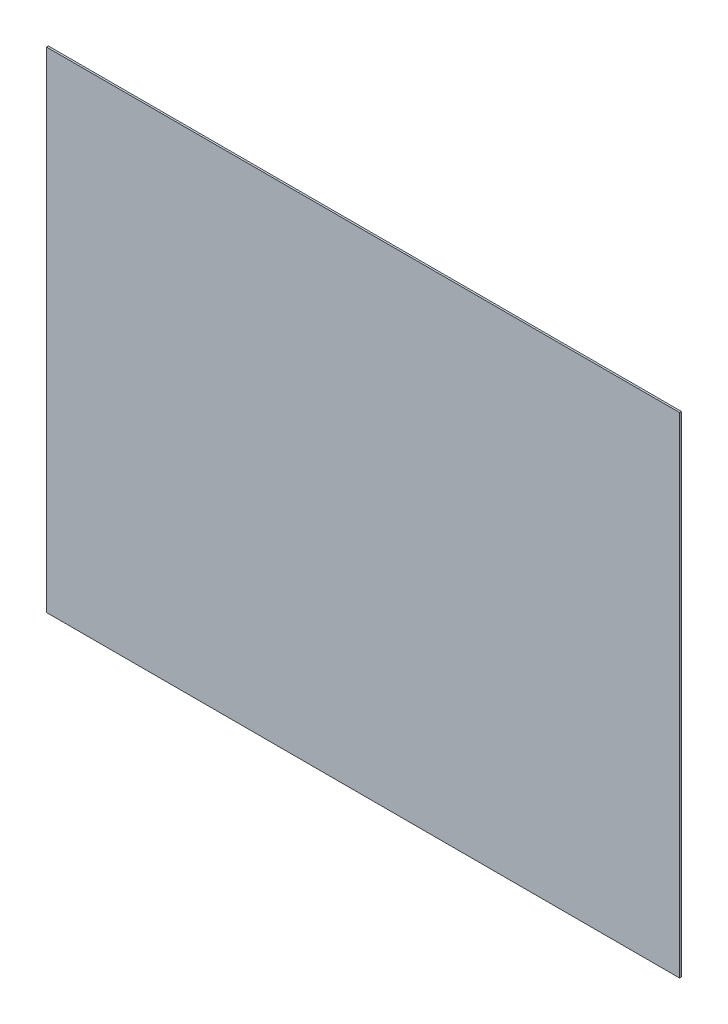
ISO-10303-21;
HEADER;
FILE_DESCRIPTION(('STEP AP214'),'2;1');
FILE_NAME('part.step','',(''),(''),'','','');
FILE_SCHEMA(('AUTOMOTIVE_DESIGN { 1 0 10303 214 1 1 1 1 }'));
ENDSEC;
DATA;
#1=APPLICATION_CONTEXT('core data for automotive mechanical design processes');
#2=APPLICATION_PROTOCOL_DEFINITION('international standard','automotive_design',2000,#1);
#3=PRODUCT_CONTEXT('',#1,'mechanical');
#4=PRODUCT('Part','Part','',(#3));
#5=PRODUCT_RELATED_PRODUCT_CATEGORY('part','',(#4));
#6=PRODUCT_DEFINITION_FORMATION('','',#4);
#7=PRODUCT_DEFINITION_CONTEXT('part definition',#1,'design');
#8=PRODUCT_DEFINITION('design','',#6,#7);
#9=PRODUCT_DEFINITION_SHAPE('','',#8);
#10=(LENGTH_UNIT() NAMED_UNIT(*) SI_UNIT(.MILLI.,.METRE.));
#11=(NAMED_UNIT(*) PLANE_ANGLE_UNIT() SI_UNIT($,.RADIAN.));
#12=(NAMED_UNIT(*) SI_UNIT($,.STERADIAN.) SOLID_ANGLE_UNIT());
#13=UNCERTAINTY_MEASURE_WITH_UNIT(LENGTH_MEASURE(1.E-05),#10,'distance_accuracy_value','');
#14=(GEOMETRIC_REPRESENTATION_CONTEXT(3) GLOBAL_UNCERTAINTY_ASSIGNED_CONTEXT((#13)) GLOBAL_UNIT_ASSIGNED_CONTEXT((#10,
#11,#12)) REPRESENTATION_CONTEXT('',''));
#15=CARTESIAN_POINT('',(0.,0.,0.));
#16=DIRECTION('',(0.,0.,1.));
#17=DIRECTION('',(1.,0.,0.));
#18=AXIS2_PLACEMENT_3D('',#15,#16,#17);
#19=CARTESIAN_POINT('',(533.4,412.75,3.175));
#20=DIRECTION('',(-1.,0.,0.));
#21=DIRECTION('',(0.,-1.,0.));
#22=AXIS2_PLACEMENT_3D('',#19,#20,#21);
#23=PLANE('',#22);
#24=DIRECTION('',(0.,1.,0.));
#25=VECTOR('',#24,1.);
#26=CARTESIAN_POINT('',(533.4,412.75,0.));
#27=LINE('',#26,#25);
#28=CARTESIAN_POINT('',(533.4,-412.75,0.));
#29=VERTEX_POINT('',#28);
#30=CARTESIAN_POINT('',(533.4,412.75,0.));
#31=VERTEX_POINT('',#30);
#32=EDGE_CURVE('E96',#29,#31,#27,.T.);
#33=ORIENTED_EDGE('',*,*,#32,.T.);
#34=DIRECTION('',(0.,0.,-1.));
#35=VECTOR('',#34,1.);
#36=CARTESIAN_POINT('',(533.4,412.75,3.175));
#37=LINE('',#36,#35);
#38=CARTESIAN_POINT('',(533.4,412.75,3.175));
#39=VERTEX_POINT('',#38);
#40=EDGE_CURVE('E11',#39,#31,#37,.T.);
#41=ORIENTED_EDGE('',*,*,#40,.F.);
#42=DIRECTION('',(0.,1.,0.));
#43=VECTOR('',#42,1.);
#44=CARTESIAN_POINT('',(533.4,412.75,3.175));
#45=LINE('',#44,#43);
#46=CARTESIAN_POINT('',(533.4,-412.75,3.175));
#47=VERTEX_POINT('',#46);
#48=EDGE_CURVE('E84',#47,#39,#45,.T.);
#49=ORIENTED_EDGE('',*,*,#48,.F.);
#50=DIRECTION('',(0.,0.,-1.));
#51=VECTOR('',#50,1.);
#52=CARTESIAN_POINT('',(533.4,-412.75,3.175));
#53=LINE('',#52,#51);
#54=EDGE_CURVE('E92',#47,#29,#53,.T.);
#55=ORIENTED_EDGE('',*,*,#54,.T.);
#56=EDGE_LOOP('',(#33,#41,#49,#55));
#57=FACE_BOUND('',#56,.T.);
#58=ADVANCED_FACE('F33',(#57),#23,.F.);
#59=CARTESIAN_POINT('',(-533.4,412.75,3.175));
#60=DIRECTION('',(0.,-1.,0.));
#61=DIRECTION('',(0.,0.,-1.));
#62=AXIS2_PLACEMENT_3D('',#59,#60,#61);
#63=PLANE('',#62);
#64=DIRECTION('',(-1.,0.,0.));
#65=VECTOR('',#64,1.);
#66=CARTESIAN_POINT('',(-533.4,412.75,0.));
#67=LINE('',#66,#65);
#68=CARTESIAN_POINT('',(-533.4,412.75,0.));
#69=VERTEX_POINT('',#68);
#70=EDGE_CURVE('E88',#31,#69,#67,.T.);
#71=ORIENTED_EDGE('',*,*,#70,.T.);
#72=DIRECTION('',(0.,0.,-1.));
#73=VECTOR('',#72,1.);
#74=CARTESIAN_POINT('',(-533.4,412.75,3.175));
#75=LINE('',#74,#73);
#76=CARTESIAN_POINT('',(-533.4,412.75,3.175));
#77=VERTEX_POINT('',#76);
#78=EDGE_CURVE('E41',#77,#69,#75,.T.);
#79=ORIENTED_EDGE('',*,*,#78,.F.);
#80=DIRECTION('',(-1.,0.,0.));
#81=VECTOR('',#80,1.);
#82=CARTESIAN_POINT('',(-533.4,412.75,3.175));
#83=LINE('',#82,#81);
#84=EDGE_CURVE('E79',#39,#77,#83,.T.);
#85=ORIENTED_EDGE('',*,*,#84,.F.);
#86=ORIENTED_EDGE('',*,*,#40,.T.);
#87=EDGE_LOOP('',(#71,#79,#85,#86));
#88=FACE_BOUND('',#87,.T.);
#89=ADVANCED_FACE('F87',(#88),#63,.F.);
#90=CARTESIAN_POINT('',(-533.4,412.75,3.175));
#91=DIRECTION('',(1.,0.,0.));
#92=DIRECTION('',(0.,1.,0.));
#93=AXIS2_PLACEMENT_3D('',#90,#91,#92);
#94=PLANE('',#93);
#95=DIRECTION('',(0.,-1.,0.));
#96=VECTOR('',#95,1.);
#97=CARTESIAN_POINT('',(-533.4,412.75,0.));
#98=LINE('',#97,#96);
#99=CARTESIAN_POINT('',(-533.4,-412.75,0.));
#100=VERTEX_POINT('',#99);
#101=EDGE_CURVE('E66',#69,#100,#98,.T.);
#102=ORIENTED_EDGE('',*,*,#101,.T.);
#103=DIRECTION('',(0.,0.,-1.));
#104=VECTOR('',#103,1.);
#105=CARTESIAN_POINT('',(-533.4,-412.75,3.175));
#106=LINE('',#105,#104);
#107=CARTESIAN_POINT('',(-533.4,-412.75,3.175));
#108=VERTEX_POINT('',#107);
#109=EDGE_CURVE('E89',#108,#100,#106,.T.);
#110=ORIENTED_EDGE('',*,*,#109,.F.);
#111=DIRECTION('',(0.,-1.,0.));
#112=VECTOR('',#111,1.);
#113=CARTESIAN_POINT('',(-533.4,412.75,3.175));
#114=LINE('',#113,#112);
#115=EDGE_CURVE('E82',#77,#108,#114,.T.);
#116=ORIENTED_EDGE('',*,*,#115,.F.);
#117=ORIENTED_EDGE('',*,*,#78,.T.);
#118=EDGE_LOOP('',(#102,#110,#116,#117));
#119=FACE_BOUND('',#118,.T.);
#120=ADVANCED_FACE('F90',(#119),#94,.F.);
#121=CARTESIAN_POINT('',(-533.4,-412.75,3.175));
#122=DIRECTION('',(0.,1.,0.));
#123=DIRECTION('',(0.,0.,1.));
#124=AXIS2_PLACEMENT_3D('',#121,#122,#123);
#125=PLANE('',#124);
#126=DIRECTION('',(1.,0.,0.));
#127=VECTOR('',#126,1.);
#128=CARTESIAN_POINT('',(-533.4,-412.75,0.));
#129=LINE('',#128,#127);
#130=EDGE_CURVE('E72',#100,#29,#129,.T.);
#131=ORIENTED_EDGE('',*,*,#130,.T.);
#132=ORIENTED_EDGE('',*,*,#54,.F.);
#133=DIRECTION('',(1.,0.,0.));
#134=VECTOR('',#133,1.);
#135=CARTESIAN_POINT('',(-533.4,-412.75,3.175));
#136=LINE('',#135,#134);
#137=EDGE_CURVE('E49',#108,#47,#136,.T.);
#138=ORIENTED_EDGE('',*,*,#137,.F.);
#139=ORIENTED_EDGE('',*,*,#109,.T.);
#140=EDGE_LOOP('',(#131,#132,#138,#139));
#141=FACE_BOUND('',#140,.T.);
#142=ADVANCED_FACE('F103',(#141),#125,.F.);
#143=CARTESIAN_POINT('',(0.,0.,3.175));
#144=DIRECTION('',(0.,0.,1.));
#145=DIRECTION('',(1.,0.,0.));
#146=AXIS2_PLACEMENT_3D('',#143,#144,#145);
#147=PLANE('',#146);
#148=ORIENTED_EDGE('',*,*,#48,.T.);
#149=ORIENTED_EDGE('',*,*,#84,.T.);
#150=ORIENTED_EDGE('',*,*,#115,.T.);
#151=ORIENTED_EDGE('',*,*,#137,.T.);
#152=EDGE_LOOP('',(#148,#149,#150,#151));
#153=FACE_BOUND('',#152,.T.);
#154=ADVANCED_FACE('F80',(#153),#147,.T.);
#155=CARTESIAN_POINT('',(0.,0.,0.));
#156=DIRECTION('',(0.,0.,1.));
#157=DIRECTION('',(1.,0.,0.));
#158=AXIS2_PLACEMENT_3D('',#155,#156,#157);
#159=PLANE('',#158);
#160=ORIENTED_EDGE('',*,*,#32,.F.);
#161=ORIENTED_EDGE('',*,*,#130,.F.);
#162=ORIENTED_EDGE('',*,*,#101,.F.);
#163=ORIENTED_EDGE('',*,*,#70,.F.);
#164=EDGE_LOOP('',(#160,#161,#162,#163));
#165=FACE_BOUND('',#164,.T.);
#166=ADVANCED_FACE('F106',(#165),#159,.F.);
#167=CLOSED_SHELL('',(#58,#89,#120,#142,#154,#166));
#168=MANIFOLD_SOLID_BREP('B2',#167);
#169=ADVANCED_BREP_SHAPE_REPRESENTATION('',(#18,#168),#14);
#170=SHAPE_DEFINITION_REPRESENTATION(#9,#169);
ENDSEC;
END-ISO-10303-21;
